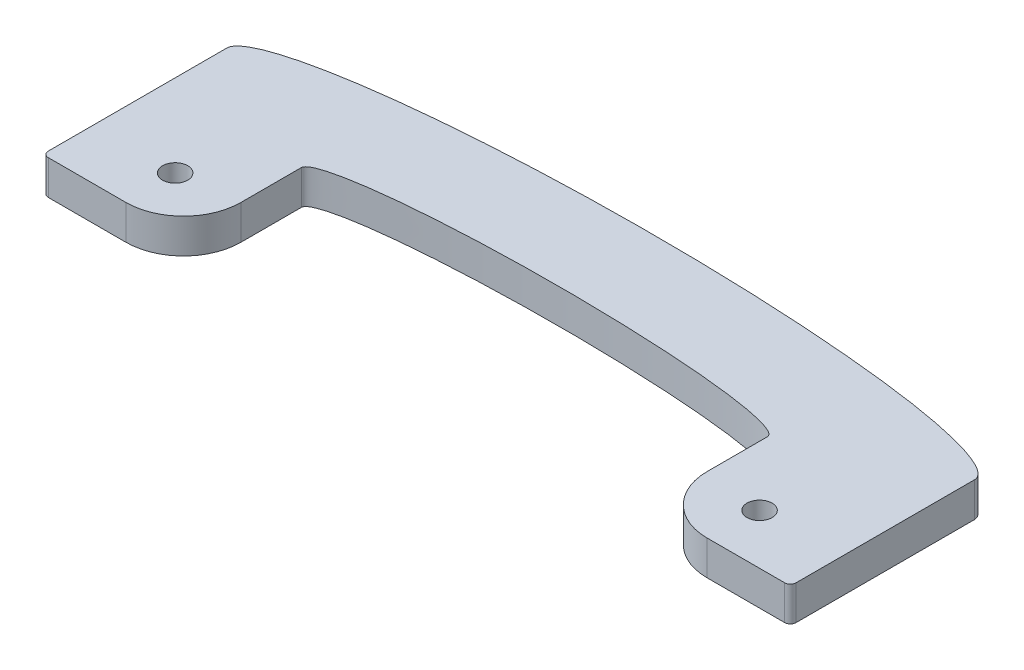
ISO-10303-21;
HEADER;
FILE_DESCRIPTION(('STEP AP214'),'2;1');
FILE_NAME('part.step','',(''),(''),'','','');
FILE_SCHEMA(('AUTOMOTIVE_DESIGN { 1 0 10303 214 1 1 1 1 }'));
ENDSEC;
DATA;
#1=APPLICATION_CONTEXT('core data for automotive mechanical design processes');
#2=APPLICATION_PROTOCOL_DEFINITION('international standard','automotive_design',2000,#1);
#3=PRODUCT_CONTEXT('',#1,'mechanical');
#4=PRODUCT('Part','Part','',(#3));
#5=PRODUCT_RELATED_PRODUCT_CATEGORY('part','',(#4));
#6=PRODUCT_DEFINITION_FORMATION('','',#4);
#7=PRODUCT_DEFINITION_CONTEXT('part definition',#1,'design');
#8=PRODUCT_DEFINITION('design','',#6,#7);
#9=PRODUCT_DEFINITION_SHAPE('','',#8);
#10=(LENGTH_UNIT() NAMED_UNIT(*) SI_UNIT(.MILLI.,.METRE.));
#11=(NAMED_UNIT(*) PLANE_ANGLE_UNIT() SI_UNIT($,.RADIAN.));
#12=(NAMED_UNIT(*) SI_UNIT($,.STERADIAN.) SOLID_ANGLE_UNIT());
#13=UNCERTAINTY_MEASURE_WITH_UNIT(LENGTH_MEASURE(1.E-05),#10,'distance_accuracy_value','');
#14=(GEOMETRIC_REPRESENTATION_CONTEXT(3) GLOBAL_UNCERTAINTY_ASSIGNED_CONTEXT((#13)) GLOBAL_UNIT_ASSIGNED_CONTEXT((#10,
#11,#12)) REPRESENTATION_CONTEXT('',''));
#15=CARTESIAN_POINT('',(0.,0.,0.));
#16=DIRECTION('',(0.,0.,1.));
#17=DIRECTION('',(1.,0.,0.));
#18=AXIS2_PLACEMENT_3D('',#15,#16,#17);
#19=CARTESIAN_POINT('',(0.,3.,0.));
#20=DIRECTION('',(0.,0.,-1.));
#21=DIRECTION('',(-1.,0.,0.));
#22=AXIS2_PLACEMENT_3D('',#19,#20,#21);
#23=PLANE('',#22);
#24=DIRECTION('',(1.,0.,0.));
#25=VECTOR('',#24,1.);
#26=CARTESIAN_POINT('',(0.,0.,0.));
#27=LINE('',#26,#25);
#28=CARTESIAN_POINT('',(25.2600000000002,0.,0.));
#29=VERTEX_POINT('',#28);
#30=CARTESIAN_POINT('',(32.,0.,0.));
#31=VERTEX_POINT('',#30);
#32=EDGE_CURVE('E208',#29,#31,#27,.T.);
#33=ORIENTED_EDGE('',*,*,#32,.T.);
#34=DIRECTION('',(0.,-1.,0.));
#35=VECTOR('',#34,1.);
#36=CARTESIAN_POINT('',(32.,3.,0.));
#37=LINE('',#36,#35);
#38=CARTESIAN_POINT('',(32.,3.,0.));
#39=VERTEX_POINT('',#38);
#40=EDGE_CURVE('E236',#31,#39,#37,.F.);
#41=ORIENTED_EDGE('',*,*,#40,.T.);
#42=DIRECTION('',(1.,0.,0.));
#43=VECTOR('',#42,1.);
#44=CARTESIAN_POINT('',(0.,3.,0.));
#45=LINE('',#44,#43);
#46=CARTESIAN_POINT('',(25.2600000000002,3.,0.));
#47=VERTEX_POINT('',#46);
#48=EDGE_CURVE('E200',#47,#39,#45,.T.);
#49=ORIENTED_EDGE('',*,*,#48,.F.);
#50=DIRECTION('',(0.,1.,0.));
#51=VECTOR('',#50,1.);
#52=CARTESIAN_POINT('',(25.2600000000002,0.,0.));
#53=LINE('',#52,#51);
#54=EDGE_CURVE('E227',#47,#29,#53,.F.);
#55=ORIENTED_EDGE('',*,*,#54,.T.);
#56=EDGE_LOOP('',(#33,#41,#49,#55));
#57=FACE_BOUND('',#56,.T.);
#58=ADVANCED_FACE('F34',(#57),#23,.F.);
#59=CARTESIAN_POINT('',(0.,3.,-16.));
#60=DIRECTION('',(0.,1.,0.));
#61=DIRECTION('',(-1.,0.,0.));
#62=AXIS2_PLACEMENT_3D('',#59,#60,#61);
#63=ELLIPSE('',#62,32.5,4.5);
#64=DIRECTION('',(0.,-1.,0.));
#65=VECTOR('',#64,1.);
#66=SURFACE_OF_LINEAR_EXTRUSION('',#63,#65);
#67=CARTESIAN_POINT('',(0.,0.,-16.));
#68=DIRECTION('',(0.,1.,0.));
#69=DIRECTION('',(-1.,0.,0.));
#70=AXIS2_PLACEMENT_3D('',#67,#68,#69);
#71=ELLIPSE('',#70,32.5,4.5);
#72=CARTESIAN_POINT('',(32.5,0.,-16.));
#73=VERTEX_POINT('',#72);
#74=CARTESIAN_POINT('',(-32.5,0.,-16.));
#75=VERTEX_POINT('',#74);
#76=EDGE_CURVE('E204',#73,#75,#71,.T.);
#77=ORIENTED_EDGE('',*,*,#76,.T.);
#78=DIRECTION('',(0.,-1.,0.));
#79=VECTOR('',#78,1.);
#80=CARTESIAN_POINT('',(-32.5,3.,-16.));
#81=LINE('',#80,#79);
#82=CARTESIAN_POINT('',(-32.5,3.,-16.));
#83=VERTEX_POINT('',#82);
#84=EDGE_CURVE('E203',#83,#75,#81,.T.);
#85=ORIENTED_EDGE('',*,*,#84,.F.);
#86=CARTESIAN_POINT('',(32.5,3.,-16.));
#87=VERTEX_POINT('',#86);
#88=EDGE_CURVE('E191',#87,#83,#63,.T.);
#89=ORIENTED_EDGE('',*,*,#88,.F.);
#90=DIRECTION('',(0.,-1.,0.));
#91=VECTOR('',#90,1.);
#92=CARTESIAN_POINT('',(32.5,3.,-16.));
#93=LINE('',#92,#91);
#94=EDGE_CURVE('E197',#87,#73,#93,.T.);
#95=ORIENTED_EDGE('',*,*,#94,.T.);
#96=EDGE_LOOP('',(#77,#85,#89,#95));
#97=FACE_BOUND('',#96,.T.);
#98=ADVANCED_FACE('F184',(#97),#66,.F.);
#99=CARTESIAN_POINT('',(-32.5,3.,0.));
#100=DIRECTION('',(1.,0.,0.));
#101=DIRECTION('',(0.,0.,-1.));
#102=AXIS2_PLACEMENT_3D('',#99,#100,#101);
#103=PLANE('',#102);
#104=DIRECTION('',(0.,0.,1.));
#105=VECTOR('',#104,1.);
#106=CARTESIAN_POINT('',(-32.5,0.,0.));
#107=LINE('',#106,#105);
#108=CARTESIAN_POINT('',(-32.5,0.,-0.499999999999996));
#109=VERTEX_POINT('',#108);
#110=EDGE_CURVE('E206',#75,#109,#107,.T.);
#111=ORIENTED_EDGE('',*,*,#110,.T.);
#112=DIRECTION('',(0.,-1.,0.));
#113=VECTOR('',#112,1.);
#114=CARTESIAN_POINT('',(-32.5,3.,-0.499999999999996));
#115=LINE('',#114,#113);
#116=CARTESIAN_POINT('',(-32.5,3.,-0.499999999999996));
#117=VERTEX_POINT('',#116);
#118=EDGE_CURVE('E11',#109,#117,#115,.F.);
#119=ORIENTED_EDGE('',*,*,#118,.T.);
#120=DIRECTION('',(0.,0.,1.));
#121=VECTOR('',#120,1.);
#122=CARTESIAN_POINT('',(-32.5,3.,0.));
#123=LINE('',#122,#121);
#124=EDGE_CURVE('E195',#83,#117,#123,.T.);
#125=ORIENTED_EDGE('',*,*,#124,.F.);
#126=ORIENTED_EDGE('',*,*,#84,.T.);
#127=EDGE_LOOP('',(#111,#119,#125,#126));
#128=FACE_BOUND('',#127,.T.);
#129=ADVANCED_FACE('F180',(#128),#103,.F.);
#130=CARTESIAN_POINT('',(-32.,3.,0.));
#131=VERTEX_POINT('',#130);
#132=CARTESIAN_POINT('',(-25.2600000000002,3.,0.));
#133=VERTEX_POINT('',#132);
#134=EDGE_CURVE('E201',#131,#133,#45,.T.);
#135=ORIENTED_EDGE('',*,*,#134,.F.);
#136=DIRECTION('',(0.,-1.,0.));
#137=VECTOR('',#136,1.);
#138=CARTESIAN_POINT('',(-32.,3.,0.));
#139=LINE('',#138,#137);
#140=CARTESIAN_POINT('',(-32.,0.,0.));
#141=VERTEX_POINT('',#140);
#142=EDGE_CURVE('E42',#131,#141,#139,.T.);
#143=ORIENTED_EDGE('',*,*,#142,.T.);
#144=CARTESIAN_POINT('',(-25.2600000000002,0.,0.));
#145=VERTEX_POINT('',#144);
#146=EDGE_CURVE('E196',#141,#145,#27,.T.);
#147=ORIENTED_EDGE('',*,*,#146,.T.);
#148=DIRECTION('',(0.,1.,0.));
#149=VECTOR('',#148,1.);
#150=CARTESIAN_POINT('',(-25.2600000000002,3.,0.));
#151=LINE('',#150,#149);
#152=EDGE_CURVE('E212',#145,#133,#151,.T.);
#153=ORIENTED_EDGE('',*,*,#152,.T.);
#154=EDGE_LOOP('',(#135,#143,#147,#153));
#155=FACE_BOUND('',#154,.T.);
#156=ADVANCED_FACE('F173',(#155),#23,.F.);
#157=CARTESIAN_POINT('',(0.,3.,-16.));
#158=DIRECTION('',(0.,1.,0.));
#159=DIRECTION('',(0.,0.,1.));
#160=AXIS2_PLACEMENT_3D('',#157,#158,#159);
#161=PLANE('',#160);
#162=CARTESIAN_POINT('',(-25.34,3.,-4.36150000000003));
#163=DIRECTION('',(0.,-1.,0.));
#164=DIRECTION('',(0.,0.,-1.));
#165=AXIS2_PLACEMENT_3D('',#162,#163,#164);
#166=CIRCLE('',#165,1.0922);
#167=CARTESIAN_POINT('',(-25.34,3.,-5.45370000000003));
#168=VERTEX_POINT('',#167);
#169=EDGE_CURVE('E283',#168,#168,#166,.T.);
#170=ORIENTED_EDGE('',*,*,#169,.T.);
#171=EDGE_LOOP('',(#170));
#172=FACE_BOUND('',#171,.T.);
#173=CARTESIAN_POINT('',(25.46,3.,-4.36150000000003));
#174=DIRECTION('',(0.,-1.,0.));
#175=DIRECTION('',(0.,0.,-1.));
#176=AXIS2_PLACEMENT_3D('',#173,#174,#175);
#177=CIRCLE('',#176,1.0922);
#178=CARTESIAN_POINT('',(25.46,3.,-5.45370000000003));
#179=VERTEX_POINT('',#178);
#180=EDGE_CURVE('E276',#179,#179,#177,.T.);
#181=ORIENTED_EDGE('',*,*,#180,.T.);
#182=EDGE_LOOP('',(#181));
#183=FACE_BOUND('',#182,.T.);
#184=ORIENTED_EDGE('',*,*,#48,.T.);
#185=CARTESIAN_POINT('',(32.,3.,-0.500000000000004));
#186=DIRECTION('',(0.,1.,0.));
#187=DIRECTION('',(0.,0.,1.));
#188=AXIS2_PLACEMENT_3D('',#185,#186,#187);
#189=CIRCLE('',#188,0.5);
#190=CARTESIAN_POINT('',(32.5,3.,-0.500000000000004));
#191=VERTEX_POINT('',#190);
#192=EDGE_CURVE('E239',#39,#191,#189,.T.);
#193=ORIENTED_EDGE('',*,*,#192,.T.);
#194=DIRECTION('',(0.,0.,1.));
#195=VECTOR('',#194,1.);
#196=CARTESIAN_POINT('',(32.5,3.,0.));
#197=LINE('',#196,#195);
#198=EDGE_CURVE('E254',#87,#191,#197,.T.);
#199=ORIENTED_EDGE('',*,*,#198,.F.);
#200=ORIENTED_EDGE('',*,*,#88,.T.);
#201=ORIENTED_EDGE('',*,*,#124,.T.);
#202=CARTESIAN_POINT('',(-32.,3.,-0.499999999999996));
#203=DIRECTION('',(0.,1.,0.));
#204=DIRECTION('',(0.,0.,1.));
#205=AXIS2_PLACEMENT_3D('',#202,#203,#204);
#206=CIRCLE('',#205,0.5);
#207=EDGE_CURVE('E54',#117,#131,#206,.T.);
#208=ORIENTED_EDGE('',*,*,#207,.T.);
#209=ORIENTED_EDGE('',*,*,#134,.T.);
#210=CARTESIAN_POINT('',(-25.2600000000002,3.,-5.));
#211=DIRECTION('',(0.,1.,0.));
#212=DIRECTION('',(0.,0.,1.));
#213=AXIS2_PLACEMENT_3D('',#210,#211,#212);
#214=CIRCLE('',#213,5.);
#215=CARTESIAN_POINT('',(-20.2600000000002,3.,-5.00000000000016));
#216=VERTEX_POINT('',#215);
#217=EDGE_CURVE('E217',#133,#216,#214,.T.);
#218=ORIENTED_EDGE('',*,*,#217,.T.);
#219=DIRECTION('',(0.,0.,1.));
#220=VECTOR('',#219,1.);
#221=CARTESIAN_POINT('',(-20.26,3.,6.72050491138035E-13));
#222=LINE('',#221,#220);
#223=CARTESIAN_POINT('',(-20.2600000000003,3.,-10.25));
#224=VERTEX_POINT('',#223);
#225=EDGE_CURVE('E151',#224,#216,#222,.T.);
#226=ORIENTED_EDGE('',*,*,#225,.F.);
#227=CARTESIAN_POINT('',(-3.4038624409625E-13,3.,-10.25));
#228=DIRECTION('',(0.,1.,0.));
#229=DIRECTION('',(-1.,0.,0.));
#230=AXIS2_PLACEMENT_3D('',#227,#228,#229);
#231=ELLIPSE('',#230,20.26,2.25);
#232=CARTESIAN_POINT('',(20.2600000000003,3.,-10.25));
#233=VERTEX_POINT('',#232);
#234=EDGE_CURVE('E129',#233,#224,#231,.T.);
#235=ORIENTED_EDGE('',*,*,#234,.F.);
#236=DIRECTION('',(0.,0.,1.));
#237=VECTOR('',#236,1.);
#238=CARTESIAN_POINT('',(20.26,3.,6.72050491138035E-13));
#239=LINE('',#238,#237);
#240=CARTESIAN_POINT('',(20.2600000000002,3.,-5.00000000000017));
#241=VERTEX_POINT('',#240);
#242=EDGE_CURVE('E250',#233,#241,#239,.T.);
#243=ORIENTED_EDGE('',*,*,#242,.T.);
#244=CARTESIAN_POINT('',(25.2600000000002,3.,-5.));
#245=DIRECTION('',(0.,1.,0.));
#246=DIRECTION('',(0.,0.,1.));
#247=AXIS2_PLACEMENT_3D('',#244,#245,#246);
#248=CIRCLE('',#247,5.);
#249=EDGE_CURVE('E215',#241,#47,#248,.T.);
#250=ORIENTED_EDGE('',*,*,#249,.T.);
#251=EDGE_LOOP('',(#184,#193,#199,#200,#201,#208,#209,#218,#226,#235,#243,#250));
#252=FACE_BOUND('',#251,.T.);
#253=ADVANCED_FACE('F170',(#172,#183,#252),#161,.T.);
#254=CARTESIAN_POINT('',(0.,0.,-16.));
#255=DIRECTION('',(0.,1.,0.));
#256=DIRECTION('',(0.,0.,1.));
#257=AXIS2_PLACEMENT_3D('',#254,#255,#256);
#258=PLANE('',#257);
#259=CARTESIAN_POINT('',(-25.34,0.,-4.36150000000003));
#260=DIRECTION('',(0.,-1.,0.));
#261=DIRECTION('',(0.,0.,-1.));
#262=AXIS2_PLACEMENT_3D('',#259,#260,#261);
#263=CIRCLE('',#262,1.0922);
#264=CARTESIAN_POINT('',(-25.34,0.,-5.45370000000003));
#265=VERTEX_POINT('',#264);
#266=EDGE_CURVE('E285',#265,#265,#263,.T.);
#267=ORIENTED_EDGE('',*,*,#266,.F.);
#268=EDGE_LOOP('',(#267));
#269=FACE_BOUND('',#268,.T.);
#270=CARTESIAN_POINT('',(25.46,0.,-4.36150000000003));
#271=DIRECTION('',(0.,-1.,0.));
#272=DIRECTION('',(0.,0.,-1.));
#273=AXIS2_PLACEMENT_3D('',#270,#271,#272);
#274=CIRCLE('',#273,1.0922);
#275=CARTESIAN_POINT('',(25.46,0.,-5.45370000000003));
#276=VERTEX_POINT('',#275);
#277=EDGE_CURVE('E278',#276,#276,#274,.T.);
#278=ORIENTED_EDGE('',*,*,#277,.F.);
#279=EDGE_LOOP('',(#278));
#280=FACE_BOUND('',#279,.T.);
#281=DIRECTION('',(0.,0.,1.));
#282=VECTOR('',#281,1.);
#283=CARTESIAN_POINT('',(32.5,0.,0.));
#284=LINE('',#283,#282);
#285=CARTESIAN_POINT('',(32.5,0.,-0.500000000000004));
#286=VERTEX_POINT('',#285);
#287=EDGE_CURVE('E133',#73,#286,#284,.T.);
#288=ORIENTED_EDGE('',*,*,#287,.T.);
#289=CARTESIAN_POINT('',(32.,0.,-0.500000000000004));
#290=DIRECTION('',(0.,1.,0.));
#291=DIRECTION('',(0.,0.,1.));
#292=AXIS2_PLACEMENT_3D('',#289,#290,#291);
#293=CIRCLE('',#292,0.5);
#294=EDGE_CURVE('E234',#286,#31,#293,.F.);
#295=ORIENTED_EDGE('',*,*,#294,.T.);
#296=ORIENTED_EDGE('',*,*,#32,.F.);
#297=CARTESIAN_POINT('',(25.2600000000002,0.,-5.));
#298=DIRECTION('',(0.,1.,0.));
#299=DIRECTION('',(0.,0.,1.));
#300=AXIS2_PLACEMENT_3D('',#297,#298,#299);
#301=CIRCLE('',#300,5.);
#302=CARTESIAN_POINT('',(20.2600000000002,0.,-5.00000000000017));
#303=VERTEX_POINT('',#302);
#304=EDGE_CURVE('E220',#29,#303,#301,.F.);
#305=ORIENTED_EDGE('',*,*,#304,.T.);
#306=DIRECTION('',(0.,0.,1.));
#307=VECTOR('',#306,1.);
#308=CARTESIAN_POINT('',(20.26,0.,6.72050491138035E-13));
#309=LINE('',#308,#307);
#310=CARTESIAN_POINT('',(20.2600000000003,0.,-10.25));
#311=VERTEX_POINT('',#310);
#312=EDGE_CURVE('E149',#311,#303,#309,.T.);
#313=ORIENTED_EDGE('',*,*,#312,.F.);
#314=CARTESIAN_POINT('',(-3.4038624409625E-13,0.,-10.25));
#315=DIRECTION('',(0.,1.,0.));
#316=DIRECTION('',(-1.,0.,0.));
#317=AXIS2_PLACEMENT_3D('',#314,#315,#316);
#318=ELLIPSE('',#317,20.26,2.25);
#319=CARTESIAN_POINT('',(-20.2600000000003,0.,-10.25));
#320=VERTEX_POINT('',#319);
#321=EDGE_CURVE('E126',#311,#320,#318,.T.);
#322=ORIENTED_EDGE('',*,*,#321,.T.);
#323=DIRECTION('',(0.,0.,1.));
#324=VECTOR('',#323,1.);
#325=CARTESIAN_POINT('',(-20.26,0.,6.72050491138035E-13));
#326=LINE('',#325,#324);
#327=CARTESIAN_POINT('',(-20.2600000000002,0.,-5.00000000000016));
#328=VERTEX_POINT('',#327);
#329=EDGE_CURVE('E137',#320,#328,#326,.T.);
#330=ORIENTED_EDGE('',*,*,#329,.T.);
#331=CARTESIAN_POINT('',(-25.2600000000002,0.,-5.));
#332=DIRECTION('',(0.,1.,0.));
#333=DIRECTION('',(0.,0.,1.));
#334=AXIS2_PLACEMENT_3D('',#331,#332,#333);
#335=CIRCLE('',#334,5.);
#336=EDGE_CURVE('E222',#328,#145,#335,.F.);
#337=ORIENTED_EDGE('',*,*,#336,.T.);
#338=ORIENTED_EDGE('',*,*,#146,.F.);
#339=CARTESIAN_POINT('',(-32.,0.,-0.499999999999996));
#340=DIRECTION('',(0.,1.,0.));
#341=DIRECTION('',(0.,0.,1.));
#342=AXIS2_PLACEMENT_3D('',#339,#340,#341);
#343=CIRCLE('',#342,0.5);
#344=EDGE_CURVE('E232',#141,#109,#343,.F.);
#345=ORIENTED_EDGE('',*,*,#344,.T.);
#346=ORIENTED_EDGE('',*,*,#110,.F.);
#347=ORIENTED_EDGE('',*,*,#76,.F.);
#348=EDGE_LOOP('',(#288,#295,#296,#305,#313,#322,#330,#337,#338,#345,#346,#347));
#349=FACE_BOUND('',#348,.T.);
#350=ADVANCED_FACE('F147',(#269,#280,#349),#258,.F.);
#351=CARTESIAN_POINT('',(32.5,3.,0.));
#352=DIRECTION('',(1.,0.,0.));
#353=DIRECTION('',(0.,0.,-1.));
#354=AXIS2_PLACEMENT_3D('',#351,#352,#353);
#355=PLANE('',#354);
#356=ORIENTED_EDGE('',*,*,#198,.T.);
#357=DIRECTION('',(0.,-1.,0.));
#358=VECTOR('',#357,1.);
#359=CARTESIAN_POINT('',(32.5,0.,-0.500000000000004));
#360=LINE('',#359,#358);
#361=EDGE_CURVE('E229',#191,#286,#360,.T.);
#362=ORIENTED_EDGE('',*,*,#361,.T.);
#363=ORIENTED_EDGE('',*,*,#287,.F.);
#364=ORIENTED_EDGE('',*,*,#94,.F.);
#365=EDGE_LOOP('',(#356,#362,#363,#364));
#366=FACE_BOUND('',#365,.T.);
#367=ADVANCED_FACE('F166',(#366),#355,.T.);
#368=CARTESIAN_POINT('',(-20.26,0.,6.72050491138035E-13));
#369=DIRECTION('',(-1.,0.,0.));
#370=DIRECTION('',(0.,0.,1.));
#371=AXIS2_PLACEMENT_3D('',#368,#369,#370);
#372=PLANE('',#371);
#373=ORIENTED_EDGE('',*,*,#225,.T.);
#374=DIRECTION('',(0.,1.,0.));
#375=VECTOR('',#374,1.);
#376=CARTESIAN_POINT('',(-20.2600000000002,0.,-5.00000000000016));
#377=LINE('',#376,#375);
#378=EDGE_CURVE('E140',#216,#328,#377,.F.);
#379=ORIENTED_EDGE('',*,*,#378,.T.);
#380=ORIENTED_EDGE('',*,*,#329,.F.);
#381=DIRECTION('',(0.,1.,0.));
#382=VECTOR('',#381,1.);
#383=CARTESIAN_POINT('',(-20.2600000000003,0.,-10.25));
#384=LINE('',#383,#382);
#385=EDGE_CURVE('E122',#320,#224,#384,.T.);
#386=ORIENTED_EDGE('',*,*,#385,.T.);
#387=EDGE_LOOP('',(#373,#379,#380,#386));
#388=FACE_BOUND('',#387,.T.);
#389=ADVANCED_FACE('F138',(#388),#372,.F.);
#390=DIRECTION('',(0.,1.,0.));
#391=VECTOR('',#390,1.);
#392=SURFACE_OF_LINEAR_EXTRUSION('',#318,#391);
#393=ORIENTED_EDGE('',*,*,#234,.T.);
#394=ORIENTED_EDGE('',*,*,#385,.F.);
#395=ORIENTED_EDGE('',*,*,#321,.F.);
#396=DIRECTION('',(0.,1.,0.));
#397=VECTOR('',#396,1.);
#398=CARTESIAN_POINT('',(20.2600000000003,0.,-10.25));
#399=LINE('',#398,#397);
#400=EDGE_CURVE('E134',#311,#233,#399,.T.);
#401=ORIENTED_EDGE('',*,*,#400,.T.);
#402=EDGE_LOOP('',(#393,#394,#395,#401));
#403=FACE_BOUND('',#402,.T.);
#404=ADVANCED_FACE('F124',(#403),#392,.F.);
#405=CARTESIAN_POINT('',(20.26,0.,6.72050491138035E-13));
#406=DIRECTION('',(-1.,0.,0.));
#407=DIRECTION('',(0.,0.,1.));
#408=AXIS2_PLACEMENT_3D('',#405,#406,#407);
#409=PLANE('',#408);
#410=ORIENTED_EDGE('',*,*,#312,.T.);
#411=DIRECTION('',(0.,1.,0.));
#412=VECTOR('',#411,1.);
#413=CARTESIAN_POINT('',(20.2600000000002,3.,-5.00000000000017));
#414=LINE('',#413,#412);
#415=EDGE_CURVE('E224',#303,#241,#414,.T.);
#416=ORIENTED_EDGE('',*,*,#415,.T.);
#417=ORIENTED_EDGE('',*,*,#242,.F.);
#418=ORIENTED_EDGE('',*,*,#400,.F.);
#419=EDGE_LOOP('',(#410,#416,#417,#418));
#420=FACE_BOUND('',#419,.T.);
#421=ADVANCED_FACE('F160',(#420),#409,.T.);
#422=CARTESIAN_POINT('',(25.46,3.,-4.36150000000003));
#423=DIRECTION('',(0.,-1.,0.));
#424=DIRECTION('',(0.,0.,-1.));
#425=AXIS2_PLACEMENT_3D('',#422,#423,#424);
#426=CYLINDRICAL_SURFACE('',#425,1.0922);
#427=ORIENTED_EDGE('',*,*,#180,.F.);
#428=EDGE_LOOP('',(#427));
#429=FACE_BOUND('',#428,.T.);
#430=ORIENTED_EDGE('',*,*,#277,.T.);
#431=EDGE_LOOP('',(#430));
#432=FACE_BOUND('',#431,.T.);
#433=ADVANCED_FACE('F164',(#429,#432),#426,.F.);
#434=CARTESIAN_POINT('',(-25.34,3.,-4.36150000000003));
#435=DIRECTION('',(0.,-1.,0.));
#436=DIRECTION('',(0.,0.,-1.));
#437=AXIS2_PLACEMENT_3D('',#434,#435,#436);
#438=CYLINDRICAL_SURFACE('',#437,1.0922);
#439=ORIENTED_EDGE('',*,*,#169,.F.);
#440=EDGE_LOOP('',(#439));
#441=FACE_BOUND('',#440,.T.);
#442=ORIENTED_EDGE('',*,*,#266,.T.);
#443=EDGE_LOOP('',(#442));
#444=FACE_BOUND('',#443,.T.);
#445=ADVANCED_FACE('F291',(#441,#444),#438,.F.);
#446=CARTESIAN_POINT('',(-25.2600000000002,3.,-5.));
#447=DIRECTION('',(0.,1.,0.));
#448=DIRECTION('',(0.,0.,1.));
#449=AXIS2_PLACEMENT_3D('',#446,#447,#448);
#450=CYLINDRICAL_SURFACE('',#449,5.);
#451=ORIENTED_EDGE('',*,*,#336,.F.);
#452=ORIENTED_EDGE('',*,*,#378,.F.);
#453=ORIENTED_EDGE('',*,*,#217,.F.);
#454=ORIENTED_EDGE('',*,*,#152,.F.);
#455=EDGE_LOOP('',(#451,#452,#453,#454));
#456=FACE_BOUND('',#455,.T.);
#457=ADVANCED_FACE('F189',(#456),#450,.T.);
#458=CARTESIAN_POINT('',(25.2600000000002,0.,-5.));
#459=DIRECTION('',(0.,-1.,0.));
#460=DIRECTION('',(0.,0.,-1.));
#461=AXIS2_PLACEMENT_3D('',#458,#459,#460);
#462=CYLINDRICAL_SURFACE('',#461,5.);
#463=ORIENTED_EDGE('',*,*,#304,.F.);
#464=ORIENTED_EDGE('',*,*,#54,.F.);
#465=ORIENTED_EDGE('',*,*,#249,.F.);
#466=ORIENTED_EDGE('',*,*,#415,.F.);
#467=EDGE_LOOP('',(#463,#464,#465,#466));
#468=FACE_BOUND('',#467,.T.);
#469=ADVANCED_FACE('F275',(#468),#462,.T.);
#470=CARTESIAN_POINT('',(32.,3.,-0.500000000000004));
#471=DIRECTION('',(0.,1.,0.));
#472=DIRECTION('',(0.,0.,1.));
#473=AXIS2_PLACEMENT_3D('',#470,#471,#472);
#474=CYLINDRICAL_SURFACE('',#473,0.5);
#475=ORIENTED_EDGE('',*,*,#192,.F.);
#476=ORIENTED_EDGE('',*,*,#40,.F.);
#477=ORIENTED_EDGE('',*,*,#294,.F.);
#478=ORIENTED_EDGE('',*,*,#361,.F.);
#479=EDGE_LOOP('',(#475,#476,#477,#478));
#480=FACE_BOUND('',#479,.T.);
#481=ADVANCED_FACE('F265',(#480),#474,.T.);
#482=CARTESIAN_POINT('',(-32.,3.,-0.499999999999996));
#483=DIRECTION('',(0.,-1.,0.));
#484=DIRECTION('',(0.,0.,-1.));
#485=AXIS2_PLACEMENT_3D('',#482,#483,#484);
#486=CYLINDRICAL_SURFACE('',#485,0.5);
#487=ORIENTED_EDGE('',*,*,#207,.F.);
#488=ORIENTED_EDGE('',*,*,#118,.F.);
#489=ORIENTED_EDGE('',*,*,#344,.F.);
#490=ORIENTED_EDGE('',*,*,#142,.F.);
#491=EDGE_LOOP('',(#487,#488,#489,#490));
#492=FACE_BOUND('',#491,.T.);
#493=ADVANCED_FACE('F36',(#492),#486,.T.);
#494=CLOSED_SHELL('',(#58,#98,#129,#156,#253,#350,#367,#389,#404,#421,#433,#445,#457,#469,#481,#493));
#495=MANIFOLD_SOLID_BREP('B2',#494);
#496=ADVANCED_BREP_SHAPE_REPRESENTATION('',(#18,#495),#14);
#497=SHAPE_DEFINITION_REPRESENTATION(#9,#496);
ENDSEC;
END-ISO-10303-21;
